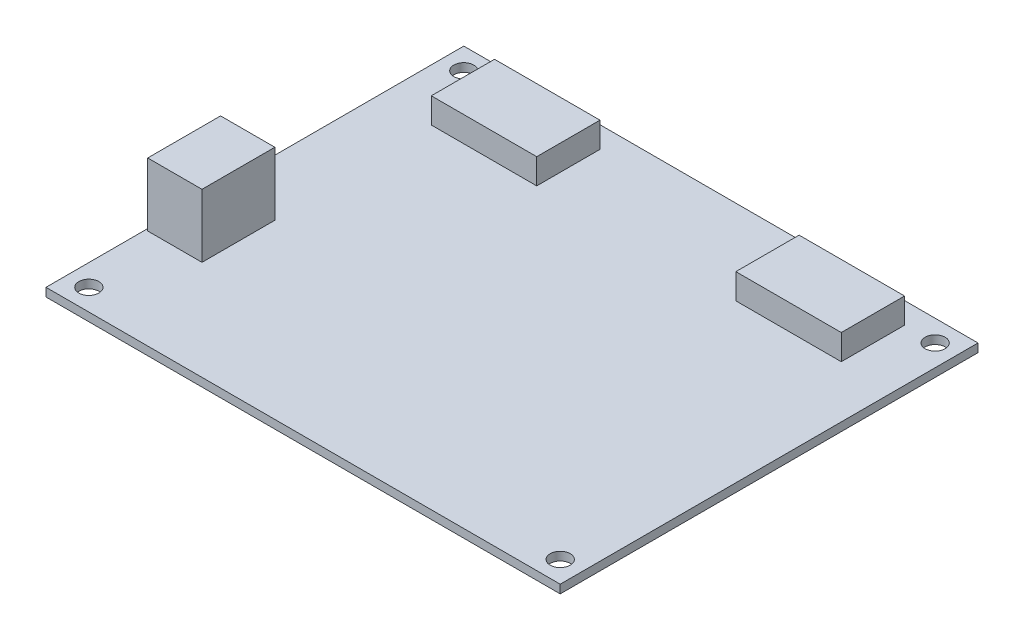
ISO-10303-21;
HEADER;
FILE_DESCRIPTION(('STEP AP214'),'2;1');
FILE_NAME('part.step','',(''),(''),'','','');
FILE_SCHEMA(('AUTOMOTIVE_DESIGN { 1 0 10303 214 1 1 1 1 }'));
ENDSEC;
DATA;
#1=APPLICATION_CONTEXT('core data for automotive mechanical design processes');
#2=APPLICATION_PROTOCOL_DEFINITION('international standard','automotive_design',2000,#1);
#3=PRODUCT_CONTEXT('',#1,'mechanical');
#4=PRODUCT('Part','Part','',(#3));
#5=PRODUCT_RELATED_PRODUCT_CATEGORY('part','',(#4));
#6=PRODUCT_DEFINITION_FORMATION('','',#4);
#7=PRODUCT_DEFINITION_CONTEXT('part definition',#1,'design');
#8=PRODUCT_DEFINITION('design','',#6,#7);
#9=PRODUCT_DEFINITION_SHAPE('','',#8);
#10=(LENGTH_UNIT() NAMED_UNIT(*) SI_UNIT(.MILLI.,.METRE.));
#11=(NAMED_UNIT(*) PLANE_ANGLE_UNIT() SI_UNIT($,.RADIAN.));
#12=(NAMED_UNIT(*) SI_UNIT($,.STERADIAN.) SOLID_ANGLE_UNIT());
#13=UNCERTAINTY_MEASURE_WITH_UNIT(LENGTH_MEASURE(1.E-05),#10,'distance_accuracy_value','');
#14=(GEOMETRIC_REPRESENTATION_CONTEXT(3) GLOBAL_UNCERTAINTY_ASSIGNED_CONTEXT((#13)) GLOBAL_UNIT_ASSIGNED_CONTEXT((#10,
#11,#12)) REPRESENTATION_CONTEXT('',''));
#15=CARTESIAN_POINT('',(0.,0.,0.));
#16=DIRECTION('',(0.,0.,1.));
#17=DIRECTION('',(1.,0.,0.));
#18=AXIS2_PLACEMENT_3D('',#15,#16,#17);
#19=CARTESIAN_POINT('',(0.,2.,0.));
#20=DIRECTION('',(0.,-1.,0.));
#21=DIRECTION('',(0.,0.,-1.));
#22=AXIS2_PLACEMENT_3D('',#19,#20,#21);
#23=PLANE('',#22);
#24=DIRECTION('',(0.,0.,-1.));
#25=VECTOR('',#24,1.);
#26=CARTESIAN_POINT('',(48.6066119782402,2.,-44.4688170181665));
#27=LINE('',#26,#25);
#28=CARTESIAN_POINT('',(48.6066119782402,2.,-29.4688170181665));
#29=VERTEX_POINT('',#28);
#30=CARTESIAN_POINT('',(48.6066119782402,2.,-44.4688170181665));
#31=VERTEX_POINT('',#30);
#32=EDGE_CURVE('E167',#29,#31,#27,.T.);
#33=ORIENTED_EDGE('',*,*,#32,.F.);
#34=DIRECTION('',(1.,0.,0.));
#35=VECTOR('',#34,1.);
#36=CARTESIAN_POINT('',(48.6066119782402,2.,-29.4688170181665));
#37=LINE('',#36,#35);
#38=CARTESIAN_POINT('',(23.6066119782402,2.,-29.4688170181665));
#39=VERTEX_POINT('',#38);
#40=EDGE_CURVE('E180',#39,#29,#37,.T.);
#41=ORIENTED_EDGE('',*,*,#40,.F.);
#42=DIRECTION('',(0.,0.,1.));
#43=VECTOR('',#42,1.);
#44=CARTESIAN_POINT('',(23.6066119782402,2.,-44.4688170181665));
#45=LINE('',#44,#43);
#46=CARTESIAN_POINT('',(23.6066119782402,2.,-44.4688170181665));
#47=VERTEX_POINT('',#46);
#48=EDGE_CURVE('E189',#47,#39,#45,.T.);
#49=ORIENTED_EDGE('',*,*,#48,.F.);
#50=DIRECTION('',(-1.,0.,0.));
#51=VECTOR('',#50,1.);
#52=CARTESIAN_POINT('',(48.6066119782402,2.,-44.4688170181665));
#53=LINE('',#52,#51);
#54=EDGE_CURVE('E170',#31,#47,#53,.T.);
#55=ORIENTED_EDGE('',*,*,#54,.F.);
#56=EDGE_LOOP('',(#33,#41,#49,#55));
#57=FACE_BOUND('',#56,.T.);
#58=DIRECTION('',(0.,0.,1.));
#59=VECTOR('',#58,1.);
#60=CARTESIAN_POINT('',(-60.9600000000001,2.,-49.5300000000001));
#61=LINE('',#60,#59);
#62=CARTESIAN_POINT('',(-60.9600000000001,2.,-49.5300000000001));
#63=VERTEX_POINT('',#62);
#64=CARTESIAN_POINT('',(-60.9600000000001,2.,49.5300000000001));
#65=VERTEX_POINT('',#64);
#66=EDGE_CURVE('E263',#63,#65,#61,.T.);
#67=ORIENTED_EDGE('',*,*,#66,.T.);
#68=DIRECTION('',(1.,0.,0.));
#69=VECTOR('',#68,1.);
#70=CARTESIAN_POINT('',(60.96,2.,49.5300000000001));
#71=LINE('',#70,#69);
#72=CARTESIAN_POINT('',(60.96,2.,49.5300000000001));
#73=VERTEX_POINT('',#72);
#74=EDGE_CURVE('E266',#65,#73,#71,.T.);
#75=ORIENTED_EDGE('',*,*,#74,.T.);
#76=DIRECTION('',(0.,0.,-1.));
#77=VECTOR('',#76,1.);
#78=CARTESIAN_POINT('',(60.96,2.,-49.5300000000001));
#79=LINE('',#78,#77);
#80=CARTESIAN_POINT('',(60.96,2.,-49.5300000000001));
#81=VERTEX_POINT('',#80);
#82=EDGE_CURVE('E269',#73,#81,#79,.T.);
#83=ORIENTED_EDGE('',*,*,#82,.T.);
#84=DIRECTION('',(-1.,0.,0.));
#85=VECTOR('',#84,1.);
#86=CARTESIAN_POINT('',(60.96,2.,-49.5300000000001));
#87=LINE('',#86,#85);
#88=EDGE_CURVE('E271',#81,#63,#87,.T.);
#89=ORIENTED_EDGE('',*,*,#88,.T.);
#90=EDGE_LOOP('',(#67,#75,#83,#89));
#91=FACE_BOUND('',#90,.T.);
#92=CARTESIAN_POINT('',(-55.8800000000001,2.,-44.4500000000001));
#93=DIRECTION('',(0.,1.,0.));
#94=DIRECTION('',(0.,0.,1.));
#95=AXIS2_PLACEMENT_3D('',#92,#93,#94);
#96=CIRCLE('',#95,2.37105424284098);
#97=CARTESIAN_POINT('',(-55.8800000000001,2.,-42.0789457571591));
#98=VERTEX_POINT('',#97);
#99=EDGE_CURVE('E254',#98,#98,#96,.T.);
#100=ORIENTED_EDGE('',*,*,#99,.F.);
#101=EDGE_LOOP('',(#100));
#102=FACE_BOUND('',#101,.T.);
#103=CARTESIAN_POINT('',(55.8800000000001,2.,-44.4500000000001));
#104=DIRECTION('',(0.,1.,0.));
#105=DIRECTION('',(0.,0.,-1.));
#106=AXIS2_PLACEMENT_3D('',#103,#104,#105);
#107=CIRCLE('',#106,2.37105424284098);
#108=CARTESIAN_POINT('',(55.8800000000001,2.,-46.8210542428411));
#109=VERTEX_POINT('',#108);
#110=EDGE_CURVE('E248',#109,#109,#107,.T.);
#111=ORIENTED_EDGE('',*,*,#110,.F.);
#112=EDGE_LOOP('',(#111));
#113=FACE_BOUND('',#112,.T.);
#114=CARTESIAN_POINT('',(55.8800000000001,2.,44.4500000000001));
#115=DIRECTION('',(0.,1.,0.));
#116=DIRECTION('',(0.,0.,1.));
#117=AXIS2_PLACEMENT_3D('',#114,#115,#116);
#118=CIRCLE('',#117,2.37105424284098);
#119=CARTESIAN_POINT('',(55.8800000000001,2.,46.8210542428411));
#120=VERTEX_POINT('',#119);
#121=EDGE_CURVE('E242',#120,#120,#118,.T.);
#122=ORIENTED_EDGE('',*,*,#121,.F.);
#123=EDGE_LOOP('',(#122));
#124=FACE_BOUND('',#123,.T.);
#125=CARTESIAN_POINT('',(-55.8800000000001,2.,44.4500000000001));
#126=DIRECTION('',(0.,1.,0.));
#127=DIRECTION('',(0.,0.,-1.));
#128=AXIS2_PLACEMENT_3D('',#125,#126,#127);
#129=CIRCLE('',#128,2.37105424284098);
#130=CARTESIAN_POINT('',(-55.8800000000001,2.,42.0789457571591));
#131=VERTEX_POINT('',#130);
#132=EDGE_CURVE('E238',#131,#131,#129,.T.);
#133=ORIENTED_EDGE('',*,*,#132,.F.);
#134=EDGE_LOOP('',(#133));
#135=FACE_BOUND('',#134,.T.);
#136=DIRECTION('',(0.,0.,-1.));
#137=VECTOR('',#136,1.);
#138=CARTESIAN_POINT('',(-23.6066119782402,2.,-44.4688170181665));
#139=LINE('',#138,#137);
#140=CARTESIAN_POINT('',(-23.6066119782402,2.,-29.4688170181665));
#141=VERTEX_POINT('',#140);
#142=CARTESIAN_POINT('',(-23.6066119782402,2.,-44.4688170181665));
#143=VERTEX_POINT('',#142);
#144=EDGE_CURVE('E205',#141,#143,#139,.T.);
#145=ORIENTED_EDGE('',*,*,#144,.F.);
#146=DIRECTION('',(1.,0.,0.));
#147=VECTOR('',#146,1.);
#148=CARTESIAN_POINT('',(-48.6066119782402,2.,-29.4688170181665));
#149=LINE('',#148,#147);
#150=CARTESIAN_POINT('',(-48.6066119782402,2.,-29.4688170181665));
#151=VERTEX_POINT('',#150);
#152=EDGE_CURVE('E210',#151,#141,#149,.T.);
#153=ORIENTED_EDGE('',*,*,#152,.F.);
#154=DIRECTION('',(0.,0.,1.));
#155=VECTOR('',#154,1.);
#156=CARTESIAN_POINT('',(-48.6066119782402,2.,-44.4688170181665));
#157=LINE('',#156,#155);
#158=CARTESIAN_POINT('',(-48.6066119782402,2.,-44.4688170181665));
#159=VERTEX_POINT('',#158);
#160=EDGE_CURVE('E222',#159,#151,#157,.T.);
#161=ORIENTED_EDGE('',*,*,#160,.F.);
#162=DIRECTION('',(-1.,0.,0.));
#163=VECTOR('',#162,1.);
#164=CARTESIAN_POINT('',(-48.6066119782402,2.,-44.4688170181665));
#165=LINE('',#164,#163);
#166=EDGE_CURVE('E219',#143,#159,#165,.T.);
#167=ORIENTED_EDGE('',*,*,#166,.F.);
#168=EDGE_LOOP('',(#145,#153,#161,#167));
#169=FACE_BOUND('',#168,.T.);
#170=DIRECTION('',(0.,0.,-1.));
#171=VECTOR('',#170,1.);
#172=CARTESIAN_POINT('',(-47.5904458741655,2.,8.63741188463502));
#173=LINE('',#172,#171);
#174=CARTESIAN_POINT('',(-47.5904458741655,2.,25.912235653905));
#175=VERTEX_POINT('',#174);
#176=CARTESIAN_POINT('',(-47.5904458741655,2.,8.63741188463502));
#177=VERTEX_POINT('',#176);
#178=EDGE_CURVE('E166',#175,#177,#173,.T.);
#179=ORIENTED_EDGE('',*,*,#178,.F.);
#180=DIRECTION('',(1.,0.,0.));
#181=VECTOR('',#180,1.);
#182=CARTESIAN_POINT('',(-60.4618831924451,2.,25.912235653905));
#183=LINE('',#182,#181);
#184=CARTESIAN_POINT('',(-60.4618831924451,2.,25.912235653905));
#185=VERTEX_POINT('',#184);
#186=EDGE_CURVE('E163',#185,#175,#183,.T.);
#187=ORIENTED_EDGE('',*,*,#186,.F.);
#188=DIRECTION('',(0.,0.,1.));
#189=VECTOR('',#188,1.);
#190=CARTESIAN_POINT('',(-60.4618831924451,2.,8.63741188463502));
#191=LINE('',#190,#189);
#192=CARTESIAN_POINT('',(-60.4618831924451,2.,8.63741188463502));
#193=VERTEX_POINT('',#192);
#194=EDGE_CURVE('E53',#193,#185,#191,.T.);
#195=ORIENTED_EDGE('',*,*,#194,.F.);
#196=DIRECTION('',(-1.,0.,0.));
#197=VECTOR('',#196,1.);
#198=CARTESIAN_POINT('',(-60.4618831924451,2.,8.63741188463502));
#199=LINE('',#198,#197);
#200=EDGE_CURVE('E48',#177,#193,#199,.T.);
#201=ORIENTED_EDGE('',*,*,#200,.F.);
#202=EDGE_LOOP('',(#179,#187,#195,#201));
#203=FACE_BOUND('',#202,.T.);
#204=ADVANCED_FACE('F33',(#57,#91,#102,#113,#124,#135,#169,#203),#23,.F.);
#205=CARTESIAN_POINT('',(-60.9600000000001,2.,-49.5300000000001));
#206=DIRECTION('',(1.,0.,0.));
#207=DIRECTION('',(0.,0.,-1.));
#208=AXIS2_PLACEMENT_3D('',#205,#206,#207);
#209=PLANE('',#208);
#210=DIRECTION('',(0.,0.,1.));
#211=VECTOR('',#210,1.);
#212=CARTESIAN_POINT('',(-60.9600000000001,0.,-49.5300000000001));
#213=LINE('',#212,#211);
#214=CARTESIAN_POINT('',(-60.9600000000001,0.,-49.5300000000001));
#215=VERTEX_POINT('',#214);
#216=CARTESIAN_POINT('',(-60.9600000000001,0.,49.5300000000001));
#217=VERTEX_POINT('',#216);
#218=EDGE_CURVE('E260',#215,#217,#213,.T.);
#219=ORIENTED_EDGE('',*,*,#218,.T.);
#220=DIRECTION('',(0.,-1.,0.));
#221=VECTOR('',#220,1.);
#222=CARTESIAN_POINT('',(-60.9600000000001,2.,49.5300000000001));
#223=LINE('',#222,#221);
#224=EDGE_CURVE('E11',#65,#217,#223,.T.);
#225=ORIENTED_EDGE('',*,*,#224,.F.);
#226=ORIENTED_EDGE('',*,*,#66,.F.);
#227=DIRECTION('',(0.,-1.,0.));
#228=VECTOR('',#227,1.);
#229=CARTESIAN_POINT('',(-60.9600000000001,2.,-49.5300000000001));
#230=LINE('',#229,#228);
#231=EDGE_CURVE('E273',#63,#215,#230,.T.);
#232=ORIENTED_EDGE('',*,*,#231,.T.);
#233=EDGE_LOOP('',(#219,#225,#226,#232));
#234=FACE_BOUND('',#233,.T.);
#235=ADVANCED_FACE('F35',(#234),#209,.F.);
#236=CARTESIAN_POINT('',(60.96,2.,49.5300000000001));
#237=DIRECTION('',(0.,0.,-1.));
#238=DIRECTION('',(-1.,0.,0.));
#239=AXIS2_PLACEMENT_3D('',#236,#237,#238);
#240=PLANE('',#239);
#241=DIRECTION('',(1.,0.,0.));
#242=VECTOR('',#241,1.);
#243=CARTESIAN_POINT('',(60.96,0.,49.5300000000001));
#244=LINE('',#243,#242);
#245=CARTESIAN_POINT('',(60.96,0.,49.5300000000001));
#246=VERTEX_POINT('',#245);
#247=EDGE_CURVE('E276',#217,#246,#244,.T.);
#248=ORIENTED_EDGE('',*,*,#247,.T.);
#249=DIRECTION('',(0.,-1.,0.));
#250=VECTOR('',#249,1.);
#251=CARTESIAN_POINT('',(60.96,2.,49.5300000000001));
#252=LINE('',#251,#250);
#253=EDGE_CURVE('E41',#73,#246,#252,.T.);
#254=ORIENTED_EDGE('',*,*,#253,.F.);
#255=ORIENTED_EDGE('',*,*,#74,.F.);
#256=ORIENTED_EDGE('',*,*,#224,.T.);
#257=EDGE_LOOP('',(#248,#254,#255,#256));
#258=FACE_BOUND('',#257,.T.);
#259=ADVANCED_FACE('F306',(#258),#240,.F.);
#260=CARTESIAN_POINT('',(60.96,2.,-49.5300000000001));
#261=DIRECTION('',(-1.,0.,0.));
#262=DIRECTION('',(0.,0.,1.));
#263=AXIS2_PLACEMENT_3D('',#260,#261,#262);
#264=PLANE('',#263);
#265=DIRECTION('',(0.,0.,-1.));
#266=VECTOR('',#265,1.);
#267=CARTESIAN_POINT('',(60.96,0.,-49.5300000000001));
#268=LINE('',#267,#266);
#269=CARTESIAN_POINT('',(60.96,0.,-49.5300000000001));
#270=VERTEX_POINT('',#269);
#271=EDGE_CURVE('E278',#246,#270,#268,.T.);
#272=ORIENTED_EDGE('',*,*,#271,.T.);
#273=DIRECTION('',(0.,-1.,0.));
#274=VECTOR('',#273,1.);
#275=CARTESIAN_POINT('',(60.96,2.,-49.5300000000001));
#276=LINE('',#275,#274);
#277=EDGE_CURVE('E283',#81,#270,#276,.T.);
#278=ORIENTED_EDGE('',*,*,#277,.F.);
#279=ORIENTED_EDGE('',*,*,#82,.F.);
#280=ORIENTED_EDGE('',*,*,#253,.T.);
#281=EDGE_LOOP('',(#272,#278,#279,#280));
#282=FACE_BOUND('',#281,.T.);
#283=ADVANCED_FACE('F290',(#282),#264,.F.);
#284=CARTESIAN_POINT('',(60.96,2.,-49.5300000000001));
#285=DIRECTION('',(0.,0.,1.));
#286=DIRECTION('',(1.,0.,0.));
#287=AXIS2_PLACEMENT_3D('',#284,#285,#286);
#288=PLANE('',#287);
#289=DIRECTION('',(-1.,0.,0.));
#290=VECTOR('',#289,1.);
#291=CARTESIAN_POINT('',(60.96,0.,-49.5300000000001));
#292=LINE('',#291,#290);
#293=EDGE_CURVE('E267',#270,#215,#292,.T.);
#294=ORIENTED_EDGE('',*,*,#293,.T.);
#295=ORIENTED_EDGE('',*,*,#231,.F.);
#296=ORIENTED_EDGE('',*,*,#88,.F.);
#297=ORIENTED_EDGE('',*,*,#277,.T.);
#298=EDGE_LOOP('',(#294,#295,#296,#297));
#299=FACE_BOUND('',#298,.T.);
#300=ADVANCED_FACE('F299',(#299),#288,.F.);
#301=CARTESIAN_POINT('',(0.,0.,0.));
#302=DIRECTION('',(0.,-1.,0.));
#303=DIRECTION('',(0.,0.,-1.));
#304=AXIS2_PLACEMENT_3D('',#301,#302,#303);
#305=PLANE('',#304);
#306=CARTESIAN_POINT('',(-55.8800000000001,0.,44.4500000000001));
#307=DIRECTION('',(0.,1.,0.));
#308=DIRECTION('',(0.,0.,-1.));
#309=AXIS2_PLACEMENT_3D('',#306,#307,#308);
#310=CIRCLE('',#309,2.37105424284098);
#311=CARTESIAN_POINT('',(-55.8800000000001,0.,42.0789457571591));
#312=VERTEX_POINT('',#311);
#313=EDGE_CURVE('E239',#312,#312,#310,.T.);
#314=ORIENTED_EDGE('',*,*,#313,.T.);
#315=EDGE_LOOP('',(#314));
#316=FACE_BOUND('',#315,.T.);
#317=CARTESIAN_POINT('',(55.8800000000001,0.,44.4500000000001));
#318=DIRECTION('',(0.,1.,0.));
#319=DIRECTION('',(0.,0.,1.));
#320=AXIS2_PLACEMENT_3D('',#317,#318,#319);
#321=CIRCLE('',#320,2.37105424284098);
#322=CARTESIAN_POINT('',(55.8800000000001,0.,46.8210542428411));
#323=VERTEX_POINT('',#322);
#324=EDGE_CURVE('E245',#323,#323,#321,.T.);
#325=ORIENTED_EDGE('',*,*,#324,.T.);
#326=EDGE_LOOP('',(#325));
#327=FACE_BOUND('',#326,.T.);
#328=CARTESIAN_POINT('',(55.8800000000001,0.,-44.4500000000001));
#329=DIRECTION('',(0.,1.,0.));
#330=DIRECTION('',(0.,0.,-1.));
#331=AXIS2_PLACEMENT_3D('',#328,#329,#330);
#332=CIRCLE('',#331,2.37105424284098);
#333=CARTESIAN_POINT('',(55.8800000000001,0.,-46.8210542428411));
#334=VERTEX_POINT('',#333);
#335=EDGE_CURVE('E251',#334,#334,#332,.T.);
#336=ORIENTED_EDGE('',*,*,#335,.T.);
#337=EDGE_LOOP('',(#336));
#338=FACE_BOUND('',#337,.T.);
#339=CARTESIAN_POINT('',(-55.8800000000001,0.,-44.4500000000001));
#340=DIRECTION('',(0.,1.,0.));
#341=DIRECTION('',(0.,0.,1.));
#342=AXIS2_PLACEMENT_3D('',#339,#340,#341);
#343=CIRCLE('',#342,2.37105424284098);
#344=CARTESIAN_POINT('',(-55.8800000000001,0.,-42.0789457571591));
#345=VERTEX_POINT('',#344);
#346=EDGE_CURVE('E257',#345,#345,#343,.T.);
#347=ORIENTED_EDGE('',*,*,#346,.T.);
#348=EDGE_LOOP('',(#347));
#349=FACE_BOUND('',#348,.T.);
#350=ORIENTED_EDGE('',*,*,#218,.F.);
#351=ORIENTED_EDGE('',*,*,#293,.F.);
#352=ORIENTED_EDGE('',*,*,#271,.F.);
#353=ORIENTED_EDGE('',*,*,#247,.F.);
#354=EDGE_LOOP('',(#350,#351,#352,#353));
#355=FACE_BOUND('',#354,.T.);
#356=ADVANCED_FACE('F296',(#316,#327,#338,#349,#355),#305,.T.);
#357=CARTESIAN_POINT('',(-55.8800000000001,0.,-44.4500000000001));
#358=DIRECTION('',(0.,1.,0.));
#359=DIRECTION('',(0.,0.,1.));
#360=AXIS2_PLACEMENT_3D('',#357,#358,#359);
#361=CYLINDRICAL_SURFACE('',#360,2.37105424284098);
#362=ORIENTED_EDGE('',*,*,#346,.F.);
#363=EDGE_LOOP('',(#362));
#364=FACE_BOUND('',#363,.T.);
#365=ORIENTED_EDGE('',*,*,#99,.T.);
#366=EDGE_LOOP('',(#365));
#367=FACE_BOUND('',#366,.T.);
#368=ADVANCED_FACE('F322',(#364,#367),#361,.F.);
#369=CARTESIAN_POINT('',(55.8800000000001,0.,-44.4500000000001));
#370=DIRECTION('',(0.,1.,0.));
#371=DIRECTION('',(0.,0.,1.));
#372=AXIS2_PLACEMENT_3D('',#369,#370,#371);
#373=CYLINDRICAL_SURFACE('',#372,2.37105424284098);
#374=ORIENTED_EDGE('',*,*,#335,.F.);
#375=EDGE_LOOP('',(#374));
#376=FACE_BOUND('',#375,.T.);
#377=ORIENTED_EDGE('',*,*,#110,.T.);
#378=EDGE_LOOP('',(#377));
#379=FACE_BOUND('',#378,.T.);
#380=ADVANCED_FACE('F345',(#376,#379),#373,.F.);
#381=CARTESIAN_POINT('',(55.8800000000001,0.,44.4500000000001));
#382=DIRECTION('',(0.,1.,0.));
#383=DIRECTION('',(0.,0.,1.));
#384=AXIS2_PLACEMENT_3D('',#381,#382,#383);
#385=CYLINDRICAL_SURFACE('',#384,2.37105424284098);
#386=ORIENTED_EDGE('',*,*,#324,.F.);
#387=EDGE_LOOP('',(#386));
#388=FACE_BOUND('',#387,.T.);
#389=ORIENTED_EDGE('',*,*,#121,.T.);
#390=EDGE_LOOP('',(#389));
#391=FACE_BOUND('',#390,.T.);
#392=ADVANCED_FACE('F351',(#388,#391),#385,.F.);
#393=CARTESIAN_POINT('',(-55.8800000000001,0.,44.4500000000001));
#394=DIRECTION('',(0.,1.,0.));
#395=DIRECTION('',(0.,0.,1.));
#396=AXIS2_PLACEMENT_3D('',#393,#394,#395);
#397=CYLINDRICAL_SURFACE('',#396,2.37105424284098);
#398=ORIENTED_EDGE('',*,*,#313,.F.);
#399=EDGE_LOOP('',(#398));
#400=FACE_BOUND('',#399,.T.);
#401=ORIENTED_EDGE('',*,*,#132,.T.);
#402=EDGE_LOOP('',(#401));
#403=FACE_BOUND('',#402,.T.);
#404=ADVANCED_FACE('F358',(#400,#403),#397,.F.);
#405=CARTESIAN_POINT('',(-23.6066119782402,8.,-44.4688170181665));
#406=DIRECTION('',(-1.,0.,0.));
#407=DIRECTION('',(0.,0.,1.));
#408=AXIS2_PLACEMENT_3D('',#405,#406,#407);
#409=PLANE('',#408);
#410=ORIENTED_EDGE('',*,*,#144,.T.);
#411=DIRECTION('',(0.,-1.,0.));
#412=VECTOR('',#411,1.);
#413=CARTESIAN_POINT('',(-23.6066119782402,8.,-44.4688170181665));
#414=LINE('',#413,#412);
#415=CARTESIAN_POINT('',(-23.6066119782402,8.,-44.4688170181665));
#416=VERTEX_POINT('',#415);
#417=EDGE_CURVE('E235',#416,#143,#414,.T.);
#418=ORIENTED_EDGE('',*,*,#417,.F.);
#419=DIRECTION('',(0.,0.,-1.));
#420=VECTOR('',#419,1.);
#421=CARTESIAN_POINT('',(-23.6066119782402,8.,-44.4688170181665));
#422=LINE('',#421,#420);
#423=CARTESIAN_POINT('',(-23.6066119782402,8.,-29.4688170181665));
#424=VERTEX_POINT('',#423);
#425=EDGE_CURVE('E206',#424,#416,#422,.T.);
#426=ORIENTED_EDGE('',*,*,#425,.F.);
#427=DIRECTION('',(0.,-1.,0.));
#428=VECTOR('',#427,1.);
#429=CARTESIAN_POINT('',(-23.6066119782402,8.,-29.4688170181665));
#430=LINE('',#429,#428);
#431=EDGE_CURVE('E216',#424,#141,#430,.T.);
#432=ORIENTED_EDGE('',*,*,#431,.T.);
#433=EDGE_LOOP('',(#410,#418,#426,#432));
#434=FACE_BOUND('',#433,.T.);
#435=ADVANCED_FACE('F366',(#434),#409,.F.);
#436=CARTESIAN_POINT('',(-48.6066119782402,8.,-44.4688170181665));
#437=DIRECTION('',(0.,0.,1.));
#438=DIRECTION('',(1.,0.,0.));
#439=AXIS2_PLACEMENT_3D('',#436,#437,#438);
#440=PLANE('',#439);
#441=ORIENTED_EDGE('',*,*,#166,.T.);
#442=DIRECTION('',(0.,-1.,0.));
#443=VECTOR('',#442,1.);
#444=CARTESIAN_POINT('',(-48.6066119782402,8.,-44.4688170181665));
#445=LINE('',#444,#443);
#446=CARTESIAN_POINT('',(-48.6066119782402,8.,-44.4688170181665));
#447=VERTEX_POINT('',#446);
#448=EDGE_CURVE('E232',#447,#159,#445,.T.);
#449=ORIENTED_EDGE('',*,*,#448,.F.);
#450=DIRECTION('',(-1.,0.,0.));
#451=VECTOR('',#450,1.);
#452=CARTESIAN_POINT('',(-48.6066119782402,8.,-44.4688170181665));
#453=LINE('',#452,#451);
#454=EDGE_CURVE('E209',#416,#447,#453,.T.);
#455=ORIENTED_EDGE('',*,*,#454,.F.);
#456=ORIENTED_EDGE('',*,*,#417,.T.);
#457=EDGE_LOOP('',(#441,#449,#455,#456));
#458=FACE_BOUND('',#457,.T.);
#459=ADVANCED_FACE('F374',(#458),#440,.F.);
#460=CARTESIAN_POINT('',(-48.6066119782402,8.,-44.4688170181665));
#461=DIRECTION('',(1.,0.,0.));
#462=DIRECTION('',(0.,0.,-1.));
#463=AXIS2_PLACEMENT_3D('',#460,#461,#462);
#464=PLANE('',#463);
#465=ORIENTED_EDGE('',*,*,#160,.T.);
#466=DIRECTION('',(0.,-1.,0.));
#467=VECTOR('',#466,1.);
#468=CARTESIAN_POINT('',(-48.6066119782402,8.,-29.4688170181665));
#469=LINE('',#468,#467);
#470=CARTESIAN_POINT('',(-48.6066119782402,8.,-29.4688170181665));
#471=VERTEX_POINT('',#470);
#472=EDGE_CURVE('E229',#471,#151,#469,.T.);
#473=ORIENTED_EDGE('',*,*,#472,.F.);
#474=DIRECTION('',(0.,0.,1.));
#475=VECTOR('',#474,1.);
#476=CARTESIAN_POINT('',(-48.6066119782402,8.,-44.4688170181665));
#477=LINE('',#476,#475);
#478=EDGE_CURVE('E212',#447,#471,#477,.T.);
#479=ORIENTED_EDGE('',*,*,#478,.F.);
#480=ORIENTED_EDGE('',*,*,#448,.T.);
#481=EDGE_LOOP('',(#465,#473,#479,#480));
#482=FACE_BOUND('',#481,.T.);
#483=ADVANCED_FACE('F382',(#482),#464,.F.);
#484=CARTESIAN_POINT('',(-48.6066119782402,8.,-29.4688170181665));
#485=DIRECTION('',(0.,0.,-1.));
#486=DIRECTION('',(-1.,0.,0.));
#487=AXIS2_PLACEMENT_3D('',#484,#485,#486);
#488=PLANE('',#487);
#489=ORIENTED_EDGE('',*,*,#152,.T.);
#490=ORIENTED_EDGE('',*,*,#431,.F.);
#491=DIRECTION('',(1.,0.,0.));
#492=VECTOR('',#491,1.);
#493=CARTESIAN_POINT('',(-48.6066119782402,8.,-29.4688170181665));
#494=LINE('',#493,#492);
#495=EDGE_CURVE('E214',#471,#424,#494,.T.);
#496=ORIENTED_EDGE('',*,*,#495,.F.);
#497=ORIENTED_EDGE('',*,*,#472,.T.);
#498=EDGE_LOOP('',(#489,#490,#496,#497));
#499=FACE_BOUND('',#498,.T.);
#500=ADVANCED_FACE('F390',(#499),#488,.F.);
#501=CARTESIAN_POINT('',(0.,8.,0.));
#502=DIRECTION('',(0.,1.,0.));
#503=DIRECTION('',(0.,0.,1.));
#504=AXIS2_PLACEMENT_3D('',#501,#502,#503);
#505=PLANE('',#504);
#506=ORIENTED_EDGE('',*,*,#425,.T.);
#507=ORIENTED_EDGE('',*,*,#454,.T.);
#508=ORIENTED_EDGE('',*,*,#478,.T.);
#509=ORIENTED_EDGE('',*,*,#495,.T.);
#510=EDGE_LOOP('',(#506,#507,#508,#509));
#511=FACE_BOUND('',#510,.T.);
#512=ADVANCED_FACE('F398',(#511),#505,.T.);
#513=CARTESIAN_POINT('',(48.6066119782402,8.,-44.4688170181665));
#514=DIRECTION('',(-1.,0.,0.));
#515=DIRECTION('',(0.,0.,1.));
#516=AXIS2_PLACEMENT_3D('',#513,#514,#515);
#517=PLANE('',#516);
#518=ORIENTED_EDGE('',*,*,#32,.T.);
#519=DIRECTION('',(0.,-1.,0.));
#520=VECTOR('',#519,1.);
#521=CARTESIAN_POINT('',(48.6066119782402,8.,-44.4688170181665));
#522=LINE('',#521,#520);
#523=CARTESIAN_POINT('',(48.6066119782402,8.,-44.4688170181665));
#524=VERTEX_POINT('',#523);
#525=EDGE_CURVE('E202',#524,#31,#522,.T.);
#526=ORIENTED_EDGE('',*,*,#525,.F.);
#527=DIRECTION('',(0.,0.,-1.));
#528=VECTOR('',#527,1.);
#529=CARTESIAN_POINT('',(48.6066119782402,8.,-44.4688170181665));
#530=LINE('',#529,#528);
#531=CARTESIAN_POINT('',(48.6066119782402,8.,-29.4688170181665));
#532=VERTEX_POINT('',#531);
#533=EDGE_CURVE('E176',#532,#524,#530,.T.);
#534=ORIENTED_EDGE('',*,*,#533,.F.);
#535=DIRECTION('',(0.,-1.,0.));
#536=VECTOR('',#535,1.);
#537=CARTESIAN_POINT('',(48.6066119782402,8.,-29.4688170181665));
#538=LINE('',#537,#536);
#539=EDGE_CURVE('E185',#532,#29,#538,.T.);
#540=ORIENTED_EDGE('',*,*,#539,.T.);
#541=EDGE_LOOP('',(#518,#526,#534,#540));
#542=FACE_BOUND('',#541,.T.);
#543=ADVANCED_FACE('F406',(#542),#517,.F.);
#544=CARTESIAN_POINT('',(48.6066119782402,8.,-44.4688170181665));
#545=DIRECTION('',(0.,0.,1.));
#546=DIRECTION('',(1.,0.,0.));
#547=AXIS2_PLACEMENT_3D('',#544,#545,#546);
#548=PLANE('',#547);
#549=ORIENTED_EDGE('',*,*,#54,.T.);
#550=DIRECTION('',(0.,-1.,0.));
#551=VECTOR('',#550,1.);
#552=CARTESIAN_POINT('',(23.6066119782402,8.,-44.4688170181665));
#553=LINE('',#552,#551);
#554=CARTESIAN_POINT('',(23.6066119782402,8.,-44.4688170181665));
#555=VERTEX_POINT('',#554);
#556=EDGE_CURVE('E199',#555,#47,#553,.T.);
#557=ORIENTED_EDGE('',*,*,#556,.F.);
#558=DIRECTION('',(-1.,0.,0.));
#559=VECTOR('',#558,1.);
#560=CARTESIAN_POINT('',(48.6066119782402,8.,-44.4688170181665));
#561=LINE('',#560,#559);
#562=EDGE_CURVE('E179',#524,#555,#561,.T.);
#563=ORIENTED_EDGE('',*,*,#562,.F.);
#564=ORIENTED_EDGE('',*,*,#525,.T.);
#565=EDGE_LOOP('',(#549,#557,#563,#564));
#566=FACE_BOUND('',#565,.T.);
#567=ADVANCED_FACE('F414',(#566),#548,.F.);
#568=CARTESIAN_POINT('',(23.6066119782402,8.,-44.4688170181665));
#569=DIRECTION('',(1.,0.,0.));
#570=DIRECTION('',(0.,0.,-1.));
#571=AXIS2_PLACEMENT_3D('',#568,#569,#570);
#572=PLANE('',#571);
#573=ORIENTED_EDGE('',*,*,#48,.T.);
#574=DIRECTION('',(0.,-1.,0.));
#575=VECTOR('',#574,1.);
#576=CARTESIAN_POINT('',(23.6066119782402,8.,-29.4688170181665));
#577=LINE('',#576,#575);
#578=CARTESIAN_POINT('',(23.6066119782402,8.,-29.4688170181665));
#579=VERTEX_POINT('',#578);
#580=EDGE_CURVE('E196',#579,#39,#577,.T.);
#581=ORIENTED_EDGE('',*,*,#580,.F.);
#582=DIRECTION('',(0.,0.,1.));
#583=VECTOR('',#582,1.);
#584=CARTESIAN_POINT('',(23.6066119782402,8.,-44.4688170181665));
#585=LINE('',#584,#583);
#586=EDGE_CURVE('E182',#555,#579,#585,.T.);
#587=ORIENTED_EDGE('',*,*,#586,.F.);
#588=ORIENTED_EDGE('',*,*,#556,.T.);
#589=EDGE_LOOP('',(#573,#581,#587,#588));
#590=FACE_BOUND('',#589,.T.);
#591=ADVANCED_FACE('F422',(#590),#572,.F.);
#592=CARTESIAN_POINT('',(48.6066119782402,8.,-29.4688170181665));
#593=DIRECTION('',(0.,0.,-1.));
#594=DIRECTION('',(-1.,0.,0.));
#595=AXIS2_PLACEMENT_3D('',#592,#593,#594);
#596=PLANE('',#595);
#597=ORIENTED_EDGE('',*,*,#40,.T.);
#598=ORIENTED_EDGE('',*,*,#539,.F.);
#599=DIRECTION('',(1.,0.,0.));
#600=VECTOR('',#599,1.);
#601=CARTESIAN_POINT('',(48.6066119782402,8.,-29.4688170181665));
#602=LINE('',#601,#600);
#603=EDGE_CURVE('E184',#579,#532,#602,.T.);
#604=ORIENTED_EDGE('',*,*,#603,.F.);
#605=ORIENTED_EDGE('',*,*,#580,.T.);
#606=EDGE_LOOP('',(#597,#598,#604,#605));
#607=FACE_BOUND('',#606,.T.);
#608=ADVANCED_FACE('F430',(#607),#596,.F.);
#609=CARTESIAN_POINT('',(0.,8.,0.));
#610=DIRECTION('',(0.,-1.,0.));
#611=DIRECTION('',(0.,0.,-1.));
#612=AXIS2_PLACEMENT_3D('',#609,#610,#611);
#613=PLANE('',#612);
#614=ORIENTED_EDGE('',*,*,#533,.T.);
#615=ORIENTED_EDGE('',*,*,#562,.T.);
#616=ORIENTED_EDGE('',*,*,#586,.T.);
#617=ORIENTED_EDGE('',*,*,#603,.T.);
#618=EDGE_LOOP('',(#614,#615,#616,#617));
#619=FACE_BOUND('',#618,.T.);
#620=ADVANCED_FACE('F438',(#619),#613,.F.);
#621=CARTESIAN_POINT('',(-47.5904458741655,17.,8.63741188463502));
#622=DIRECTION('',(-1.,0.,0.));
#623=DIRECTION('',(0.,0.,1.));
#624=AXIS2_PLACEMENT_3D('',#621,#622,#623);
#625=PLANE('',#624);
#626=ORIENTED_EDGE('',*,*,#178,.T.);
#627=DIRECTION('',(0.,-1.,0.));
#628=VECTOR('',#627,1.);
#629=CARTESIAN_POINT('',(-47.5904458741655,17.,8.63741188463502));
#630=LINE('',#629,#628);
#631=CARTESIAN_POINT('',(-47.5904458741655,17.,8.63741188463502));
#632=VERTEX_POINT('',#631);
#633=EDGE_CURVE('E147',#632,#177,#630,.T.);
#634=ORIENTED_EDGE('',*,*,#633,.F.);
#635=DIRECTION('',(0.,0.,-1.));
#636=VECTOR('',#635,1.);
#637=CARTESIAN_POINT('',(-47.5904458741655,17.,8.63741188463502));
#638=LINE('',#637,#636);
#639=CARTESIAN_POINT('',(-47.5904458741655,17.,25.912235653905));
#640=VERTEX_POINT('',#639);
#641=EDGE_CURVE('E154',#640,#632,#638,.T.);
#642=ORIENTED_EDGE('',*,*,#641,.F.);
#643=DIRECTION('',(0.,-1.,0.));
#644=VECTOR('',#643,1.);
#645=CARTESIAN_POINT('',(-47.5904458741655,17.,25.912235653905));
#646=LINE('',#645,#644);
#647=EDGE_CURVE('E497',#640,#175,#646,.T.);
#648=ORIENTED_EDGE('',*,*,#647,.T.);
#649=EDGE_LOOP('',(#626,#634,#642,#648));
#650=FACE_BOUND('',#649,.T.);
#651=ADVANCED_FACE('F165',(#650),#625,.F.);
#652=CARTESIAN_POINT('',(-60.4618831924451,17.,8.63741188463502));
#653=DIRECTION('',(0.,0.,1.));
#654=DIRECTION('',(1.,0.,0.));
#655=AXIS2_PLACEMENT_3D('',#652,#653,#654);
#656=PLANE('',#655);
#657=ORIENTED_EDGE('',*,*,#200,.T.);
#658=DIRECTION('',(0.,-1.,0.));
#659=VECTOR('',#658,1.);
#660=CARTESIAN_POINT('',(-60.4618831924451,17.,8.63741188463502));
#661=LINE('',#660,#659);
#662=CARTESIAN_POINT('',(-60.4618831924451,17.,8.63741188463502));
#663=VERTEX_POINT('',#662);
#664=EDGE_CURVE('E150',#663,#193,#661,.T.);
#665=ORIENTED_EDGE('',*,*,#664,.F.);
#666=DIRECTION('',(-1.,0.,0.));
#667=VECTOR('',#666,1.);
#668=CARTESIAN_POINT('',(-60.4618831924451,17.,8.63741188463502));
#669=LINE('',#668,#667);
#670=EDGE_CURVE('E143',#632,#663,#669,.T.);
#671=ORIENTED_EDGE('',*,*,#670,.F.);
#672=ORIENTED_EDGE('',*,*,#633,.T.);
#673=EDGE_LOOP('',(#657,#665,#671,#672));
#674=FACE_BOUND('',#673,.T.);
#675=ADVANCED_FACE('F145',(#674),#656,.F.);
#676=CARTESIAN_POINT('',(-60.4618831924451,17.,8.63741188463502));
#677=DIRECTION('',(1.,0.,0.));
#678=DIRECTION('',(0.,0.,-1.));
#679=AXIS2_PLACEMENT_3D('',#676,#677,#678);
#680=PLANE('',#679);
#681=ORIENTED_EDGE('',*,*,#194,.T.);
#682=DIRECTION('',(0.,-1.,0.));
#683=VECTOR('',#682,1.);
#684=CARTESIAN_POINT('',(-60.4618831924451,17.,25.912235653905));
#685=LINE('',#684,#683);
#686=CARTESIAN_POINT('',(-60.4618831924451,17.,25.912235653905));
#687=VERTEX_POINT('',#686);
#688=EDGE_CURVE('E172',#687,#185,#685,.T.);
#689=ORIENTED_EDGE('',*,*,#688,.F.);
#690=DIRECTION('',(0.,0.,1.));
#691=VECTOR('',#690,1.);
#692=CARTESIAN_POINT('',(-60.4618831924451,17.,8.63741188463502));
#693=LINE('',#692,#691);
#694=EDGE_CURVE('E153',#663,#687,#693,.T.);
#695=ORIENTED_EDGE('',*,*,#694,.F.);
#696=ORIENTED_EDGE('',*,*,#664,.T.);
#697=EDGE_LOOP('',(#681,#689,#695,#696));
#698=FACE_BOUND('',#697,.T.);
#699=ADVANCED_FACE('F461',(#698),#680,.F.);
#700=CARTESIAN_POINT('',(-60.4618831924451,17.,25.912235653905));
#701=DIRECTION('',(0.,0.,-1.));
#702=DIRECTION('',(-1.,0.,0.));
#703=AXIS2_PLACEMENT_3D('',#700,#701,#702);
#704=PLANE('',#703);
#705=ORIENTED_EDGE('',*,*,#186,.T.);
#706=ORIENTED_EDGE('',*,*,#647,.F.);
#707=DIRECTION('',(1.,0.,0.));
#708=VECTOR('',#707,1.);
#709=CARTESIAN_POINT('',(-60.4618831924451,17.,25.912235653905));
#710=LINE('',#709,#708);
#711=EDGE_CURVE('E159',#687,#640,#710,.T.);
#712=ORIENTED_EDGE('',*,*,#711,.F.);
#713=ORIENTED_EDGE('',*,*,#688,.T.);
#714=EDGE_LOOP('',(#705,#706,#712,#713));
#715=FACE_BOUND('',#714,.T.);
#716=ADVANCED_FACE('F468',(#715),#704,.F.);
#717=CARTESIAN_POINT('',(0.,17.,0.));
#718=DIRECTION('',(0.,1.,0.));
#719=DIRECTION('',(0.,0.,1.));
#720=AXIS2_PLACEMENT_3D('',#717,#718,#719);
#721=PLANE('',#720);
#722=ORIENTED_EDGE('',*,*,#641,.T.);
#723=ORIENTED_EDGE('',*,*,#670,.T.);
#724=ORIENTED_EDGE('',*,*,#694,.T.);
#725=ORIENTED_EDGE('',*,*,#711,.T.);
#726=EDGE_LOOP('',(#722,#723,#724,#725));
#727=FACE_BOUND('',#726,.T.);
#728=ADVANCED_FACE('F157',(#727),#721,.T.);
#729=CLOSED_SHELL('',(#204,#235,#259,#283,#300,#356,#368,#380,#392,#404,#435,#459,#483,#500,
#512,#543,#567,#591,#608,#620,#651,#675,#699,#716,#728));
#730=MANIFOLD_SOLID_BREP('B2',#729);
#731=ADVANCED_BREP_SHAPE_REPRESENTATION('',(#18,#730),#14);
#732=SHAPE_DEFINITION_REPRESENTATION(#9,#731);
ENDSEC;
END-ISO-10303-21;
